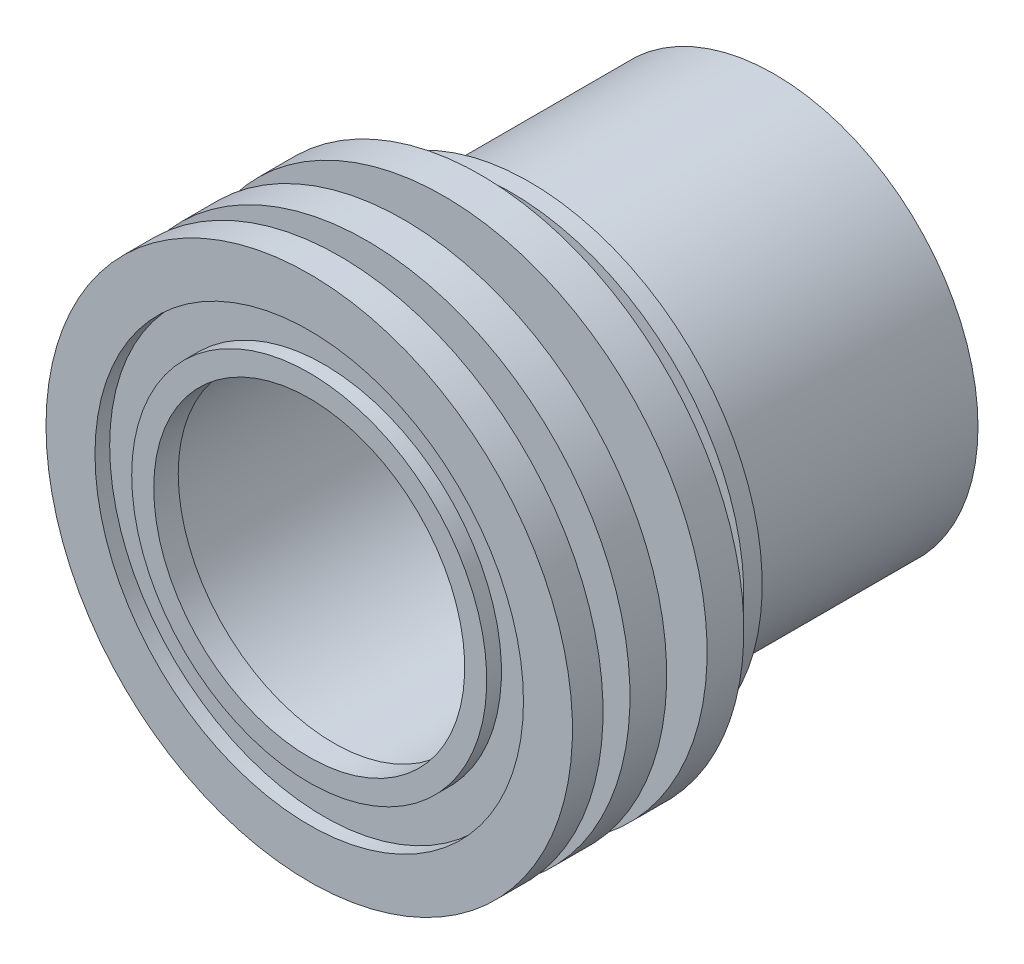
ISO-10303-21;
HEADER;
FILE_DESCRIPTION(('STEP AP214'),'2;1');
FILE_NAME('part.step','',(''),(''),'','','');
FILE_SCHEMA(('AUTOMOTIVE_DESIGN { 1 0 10303 214 1 1 1 1 }'));
ENDSEC;
DATA;
#1=APPLICATION_CONTEXT('core data for automotive mechanical design processes');
#2=APPLICATION_PROTOCOL_DEFINITION('international standard','automotive_design',2000,#1);
#3=PRODUCT_CONTEXT('',#1,'mechanical');
#4=PRODUCT('Part','Part','',(#3));
#5=PRODUCT_RELATED_PRODUCT_CATEGORY('part','',(#4));
#6=PRODUCT_DEFINITION_FORMATION('','',#4);
#7=PRODUCT_DEFINITION_CONTEXT('part definition',#1,'design');
#8=PRODUCT_DEFINITION('design','',#6,#7);
#9=PRODUCT_DEFINITION_SHAPE('','',#8);
#10=(LENGTH_UNIT() NAMED_UNIT(*) SI_UNIT(.MILLI.,.METRE.));
#11=(NAMED_UNIT(*) PLANE_ANGLE_UNIT() SI_UNIT($,.RADIAN.));
#12=(NAMED_UNIT(*) SI_UNIT($,.STERADIAN.) SOLID_ANGLE_UNIT());
#13=UNCERTAINTY_MEASURE_WITH_UNIT(LENGTH_MEASURE(1.E-05),#10,'distance_accuracy_value','');
#14=(GEOMETRIC_REPRESENTATION_CONTEXT(3) GLOBAL_UNCERTAINTY_ASSIGNED_CONTEXT((#13)) GLOBAL_UNIT_ASSIGNED_CONTEXT((#10,
#11,#12)) REPRESENTATION_CONTEXT('',''));
#15=CARTESIAN_POINT('',(0.,0.,0.));
#16=DIRECTION('',(0.,0.,1.));
#17=DIRECTION('',(1.,0.,0.));
#18=AXIS2_PLACEMENT_3D('',#15,#16,#17);
#19=CARTESIAN_POINT('',(0.,0.,17.));
#20=DIRECTION('',(0.,0.,1.));
#21=DIRECTION('',(-1.,0.,0.));
#22=AXIS2_PLACEMENT_3D('',#19,#20,#21);
#23=CYLINDRICAL_SURFACE('',#22,12.7);
#24=CARTESIAN_POINT('',(0.,0.,16.));
#25=DIRECTION('',(0.,0.,-1.));
#26=DIRECTION('',(-1.,0.,0.));
#27=AXIS2_PLACEMENT_3D('',#24,#25,#26);
#28=CIRCLE('',#27,12.7);
#29=CARTESIAN_POINT('',(-12.7,0.,16.));
#30=VERTEX_POINT('',#29);
#31=EDGE_CURVE('E10',#30,#30,#28,.T.);
#32=ORIENTED_EDGE('',*,*,#31,.T.);
#33=EDGE_LOOP('',(#32));
#34=FACE_BOUND('',#33,.T.);
#35=CARTESIAN_POINT('',(0.,0.,18.));
#36=DIRECTION('',(0.,0.,-1.));
#37=DIRECTION('',(-1.,0.,0.));
#38=AXIS2_PLACEMENT_3D('',#35,#36,#37);
#39=CIRCLE('',#38,12.7);
#40=CARTESIAN_POINT('',(-12.7,0.,18.));
#41=VERTEX_POINT('',#40);
#42=EDGE_CURVE('E126',#41,#41,#39,.T.);
#43=ORIENTED_EDGE('',*,*,#42,.F.);
#44=EDGE_LOOP('',(#43));
#45=FACE_BOUND('',#44,.T.);
#46=ADVANCED_FACE('F15',(#34,#45),#23,.F.);
#47=CARTESIAN_POINT('',(-13.1,0.,16.));
#48=DIRECTION('',(0.,0.,-1.));
#49=DIRECTION('',(-1.,0.,0.));
#50=AXIS2_PLACEMENT_3D('',#47,#48,#49);
#51=PLANE('',#50);
#52=CARTESIAN_POINT('',(0.,0.,16.));
#53=DIRECTION('',(0.,0.,-1.));
#54=DIRECTION('',(-1.,0.,0.));
#55=AXIS2_PLACEMENT_3D('',#52,#53,#54);
#56=CIRCLE('',#55,13.5);
#57=CARTESIAN_POINT('',(-13.5,0.,16.));
#58=VERTEX_POINT('',#57);
#59=EDGE_CURVE('E19',#58,#58,#56,.T.);
#60=ORIENTED_EDGE('',*,*,#59,.T.);
#61=EDGE_LOOP('',(#60));
#62=FACE_BOUND('',#61,.T.);
#63=ORIENTED_EDGE('',*,*,#31,.F.);
#64=EDGE_LOOP('',(#63));
#65=FACE_BOUND('',#64,.T.);
#66=ADVANCED_FACE('F17',(#62,#65),#51,.T.);
#67=CARTESIAN_POINT('',(0.,0.,-2.));
#68=DIRECTION('',(0.,0.,1.));
#69=DIRECTION('',(-1.,0.,0.));
#70=AXIS2_PLACEMENT_3D('',#67,#68,#69);
#71=CYLINDRICAL_SURFACE('',#70,13.5);
#72=CARTESIAN_POINT('',(0.,0.,-20.));
#73=DIRECTION('',(0.,0.,-1.));
#74=DIRECTION('',(-1.,0.,0.));
#75=AXIS2_PLACEMENT_3D('',#72,#73,#74);
#76=CIRCLE('',#75,13.5);
#77=CARTESIAN_POINT('',(-13.5,0.,-20.));
#78=VERTEX_POINT('',#77);
#79=EDGE_CURVE('E99',#78,#78,#76,.T.);
#80=ORIENTED_EDGE('',*,*,#79,.T.);
#81=EDGE_LOOP('',(#80));
#82=FACE_BOUND('',#81,.T.);
#83=ORIENTED_EDGE('',*,*,#59,.F.);
#84=EDGE_LOOP('',(#83));
#85=FACE_BOUND('',#84,.T.);
#86=ADVANCED_FACE('F165',(#82,#85),#71,.F.);
#87=CARTESIAN_POINT('',(-15.0625,0.,-20.));
#88=DIRECTION('',(0.,0.,-1.));
#89=DIRECTION('',(-1.,0.,0.));
#90=AXIS2_PLACEMENT_3D('',#87,#88,#89);
#91=PLANE('',#90);
#92=CARTESIAN_POINT('',(0.,0.,-20.));
#93=DIRECTION('',(0.,0.,-1.));
#94=DIRECTION('',(-1.,0.,0.));
#95=AXIS2_PLACEMENT_3D('',#92,#93,#94);
#96=CIRCLE('',#95,16.625);
#97=CARTESIAN_POINT('',(-16.625,0.,-20.));
#98=VERTEX_POINT('',#97);
#99=EDGE_CURVE('E95',#98,#98,#96,.T.);
#100=ORIENTED_EDGE('',*,*,#99,.T.);
#101=EDGE_LOOP('',(#100));
#102=FACE_BOUND('',#101,.T.);
#103=ORIENTED_EDGE('',*,*,#79,.F.);
#104=EDGE_LOOP('',(#103));
#105=FACE_BOUND('',#104,.T.);
#106=ADVANCED_FACE('F96',(#102,#105),#91,.T.);
#107=CARTESIAN_POINT('',(0.,0.,-10.));
#108=DIRECTION('',(0.,0.,1.));
#109=DIRECTION('',(-1.,0.,0.));
#110=AXIS2_PLACEMENT_3D('',#107,#108,#109);
#111=CYLINDRICAL_SURFACE('',#110,16.625);
#112=CARTESIAN_POINT('',(0.,0.,0.));
#113=DIRECTION('',(0.,0.,-1.));
#114=DIRECTION('',(-1.,0.,0.));
#115=AXIS2_PLACEMENT_3D('',#112,#113,#114);
#116=CIRCLE('',#115,16.625);
#117=CARTESIAN_POINT('',(-16.625,0.,0.));
#118=VERTEX_POINT('',#117);
#119=EDGE_CURVE('E100',#118,#118,#116,.T.);
#120=ORIENTED_EDGE('',*,*,#119,.T.);
#121=EDGE_LOOP('',(#120));
#122=FACE_BOUND('',#121,.T.);
#123=ORIENTED_EDGE('',*,*,#99,.F.);
#124=EDGE_LOOP('',(#123));
#125=FACE_BOUND('',#124,.T.);
#126=ADVANCED_FACE('F243',(#122,#125),#111,.T.);
#127=CARTESIAN_POINT('',(-17.8125,0.,0.));
#128=DIRECTION('',(0.,0.,-1.));
#129=DIRECTION('',(-1.,0.,0.));
#130=AXIS2_PLACEMENT_3D('',#127,#128,#129);
#131=PLANE('',#130);
#132=CARTESIAN_POINT('',(0.,0.,0.));
#133=DIRECTION('',(0.,0.,-1.));
#134=DIRECTION('',(-1.,0.,0.));
#135=AXIS2_PLACEMENT_3D('',#132,#133,#134);
#136=CIRCLE('',#135,19.);
#137=CARTESIAN_POINT('',(-19.,0.,0.));
#138=VERTEX_POINT('',#137);
#139=EDGE_CURVE('E102',#138,#138,#136,.T.);
#140=ORIENTED_EDGE('',*,*,#139,.T.);
#141=EDGE_LOOP('',(#140));
#142=FACE_BOUND('',#141,.T.);
#143=ORIENTED_EDGE('',*,*,#119,.F.);
#144=EDGE_LOOP('',(#143));
#145=FACE_BOUND('',#144,.T.);
#146=ADVANCED_FACE('F170',(#142,#145),#131,.T.);
#147=CARTESIAN_POINT('',(0.,0.,0.75));
#148=DIRECTION('',(0.,0.,1.));
#149=DIRECTION('',(-1.,0.,0.));
#150=AXIS2_PLACEMENT_3D('',#147,#148,#149);
#151=CYLINDRICAL_SURFACE('',#150,19.);
#152=CARTESIAN_POINT('',(0.,0.,1.5));
#153=DIRECTION('',(0.,0.,-1.));
#154=DIRECTION('',(-1.,0.,0.));
#155=AXIS2_PLACEMENT_3D('',#152,#153,#154);
#156=CIRCLE('',#155,19.);
#157=CARTESIAN_POINT('',(-19.,0.,1.5));
#158=VERTEX_POINT('',#157);
#159=EDGE_CURVE('E119',#158,#158,#156,.T.);
#160=ORIENTED_EDGE('',*,*,#159,.T.);
#161=EDGE_LOOP('',(#160));
#162=FACE_BOUND('',#161,.T.);
#163=ORIENTED_EDGE('',*,*,#139,.F.);
#164=EDGE_LOOP('',(#163));
#165=FACE_BOUND('',#164,.T.);
#166=ADVANCED_FACE('F251',(#162,#165),#151,.T.);
#167=CARTESIAN_POINT('',(-17.75,0.,1.5));
#168=DIRECTION('',(0.,0.,1.));
#169=DIRECTION('',(1.,0.,0.));
#170=AXIS2_PLACEMENT_3D('',#167,#168,#169);
#171=PLANE('',#170);
#172=CARTESIAN_POINT('',(0.,0.,1.5));
#173=DIRECTION('',(0.,0.,-1.));
#174=DIRECTION('',(-1.,0.,0.));
#175=AXIS2_PLACEMENT_3D('',#172,#173,#174);
#176=CIRCLE('',#175,16.5);
#177=CARTESIAN_POINT('',(-16.5,0.,1.5));
#178=VERTEX_POINT('',#177);
#179=EDGE_CURVE('E122',#178,#178,#176,.T.);
#180=ORIENTED_EDGE('',*,*,#179,.T.);
#181=EDGE_LOOP('',(#180));
#182=FACE_BOUND('',#181,.T.);
#183=ORIENTED_EDGE('',*,*,#159,.F.);
#184=EDGE_LOOP('',(#183));
#185=FACE_BOUND('',#184,.T.);
#186=ADVANCED_FACE('F157',(#182,#185),#171,.T.);
#187=CARTESIAN_POINT('',(0.,0.,2.75));
#188=DIRECTION('',(0.,0.,1.));
#189=DIRECTION('',(-1.,0.,0.));
#190=AXIS2_PLACEMENT_3D('',#187,#188,#189);
#191=CYLINDRICAL_SURFACE('',#190,16.5);
#192=CARTESIAN_POINT('',(0.,0.,4.));
#193=DIRECTION('',(0.,0.,-1.));
#194=DIRECTION('',(-1.,0.,0.));
#195=AXIS2_PLACEMENT_3D('',#192,#193,#194);
#196=CIRCLE('',#195,16.5);
#197=CARTESIAN_POINT('',(-16.5,0.,4.));
#198=VERTEX_POINT('',#197);
#199=EDGE_CURVE('E125',#198,#198,#196,.T.);
#200=ORIENTED_EDGE('',*,*,#199,.T.);
#201=EDGE_LOOP('',(#200));
#202=FACE_BOUND('',#201,.T.);
#203=ORIENTED_EDGE('',*,*,#179,.F.);
#204=EDGE_LOOP('',(#203));
#205=FACE_BOUND('',#204,.T.);
#206=ADVANCED_FACE('F142',(#202,#205),#191,.T.);
#207=CARTESIAN_POINT('',(-19.,0.,4.));
#208=DIRECTION('',(0.,0.,-1.));
#209=DIRECTION('',(-1.,0.,0.));
#210=AXIS2_PLACEMENT_3D('',#207,#208,#209);
#211=PLANE('',#210);
#212=CARTESIAN_POINT('',(0.,0.,4.));
#213=DIRECTION('',(0.,0.,-1.));
#214=DIRECTION('',(-1.,0.,0.));
#215=AXIS2_PLACEMENT_3D('',#212,#213,#214);
#216=CIRCLE('',#215,21.5);
#217=CARTESIAN_POINT('',(-21.5,0.,4.));
#218=VERTEX_POINT('',#217);
#219=EDGE_CURVE('E138',#218,#218,#216,.T.);
#220=ORIENTED_EDGE('',*,*,#219,.T.);
#221=EDGE_LOOP('',(#220));
#222=FACE_BOUND('',#221,.T.);
#223=ORIENTED_EDGE('',*,*,#199,.F.);
#224=EDGE_LOOP('',(#223));
#225=FACE_BOUND('',#224,.T.);
#226=ADVANCED_FACE('F145',(#222,#225),#211,.T.);
#227=CARTESIAN_POINT('',(0.,0.,5.5));
#228=DIRECTION('',(0.,0.,1.));
#229=DIRECTION('',(-1.,0.,0.));
#230=AXIS2_PLACEMENT_3D('',#227,#228,#229);
#231=CYLINDRICAL_SURFACE('',#230,21.5);
#232=CARTESIAN_POINT('',(0.,0.,7.));
#233=DIRECTION('',(0.,0.,-1.));
#234=DIRECTION('',(-1.,0.,0.));
#235=AXIS2_PLACEMENT_3D('',#232,#233,#234);
#236=CIRCLE('',#235,21.5);
#237=CARTESIAN_POINT('',(-21.5,0.,7.));
#238=VERTEX_POINT('',#237);
#239=EDGE_CURVE('E136',#238,#238,#236,.T.);
#240=ORIENTED_EDGE('',*,*,#239,.T.);
#241=EDGE_LOOP('',(#240));
#242=FACE_BOUND('',#241,.T.);
#243=ORIENTED_EDGE('',*,*,#219,.F.);
#244=EDGE_LOOP('',(#243));
#245=FACE_BOUND('',#244,.T.);
#246=ADVANCED_FACE('F147',(#242,#245),#231,.T.);
#247=CARTESIAN_POINT('',(-19.,0.,7.));
#248=DIRECTION('',(0.,0.,1.));
#249=DIRECTION('',(1.,0.,0.));
#250=AXIS2_PLACEMENT_3D('',#247,#248,#249);
#251=PLANE('',#250);
#252=CARTESIAN_POINT('',(0.,0.,7.));
#253=DIRECTION('',(0.,0.,-1.));
#254=DIRECTION('',(-1.,0.,0.));
#255=AXIS2_PLACEMENT_3D('',#252,#253,#254);
#256=CIRCLE('',#255,16.5);
#257=CARTESIAN_POINT('',(-16.5,0.,7.));
#258=VERTEX_POINT('',#257);
#259=EDGE_CURVE('E134',#258,#258,#256,.T.);
#260=ORIENTED_EDGE('',*,*,#259,.T.);
#261=EDGE_LOOP('',(#260));
#262=FACE_BOUND('',#261,.T.);
#263=ORIENTED_EDGE('',*,*,#239,.F.);
#264=EDGE_LOOP('',(#263));
#265=FACE_BOUND('',#264,.T.);
#266=ADVANCED_FACE('F154',(#262,#265),#251,.T.);
#267=CARTESIAN_POINT('',(0.,0.,8.65));
#268=DIRECTION('',(0.,0.,1.));
#269=DIRECTION('',(-1.,0.,0.));
#270=AXIS2_PLACEMENT_3D('',#267,#268,#269);
#271=CYLINDRICAL_SURFACE('',#270,16.5);
#272=CARTESIAN_POINT('',(0.,0.,10.3));
#273=DIRECTION('',(0.,0.,-1.));
#274=DIRECTION('',(-1.,0.,0.));
#275=AXIS2_PLACEMENT_3D('',#272,#273,#274);
#276=CIRCLE('',#275,16.5);
#277=CARTESIAN_POINT('',(-16.5,0.,10.3));
#278=VERTEX_POINT('',#277);
#279=EDGE_CURVE('E137',#278,#278,#276,.T.);
#280=ORIENTED_EDGE('',*,*,#279,.T.);
#281=EDGE_LOOP('',(#280));
#282=FACE_BOUND('',#281,.T.);
#283=ORIENTED_EDGE('',*,*,#259,.F.);
#284=EDGE_LOOP('',(#283));
#285=FACE_BOUND('',#284,.T.);
#286=ADVANCED_FACE('F207',(#282,#285),#271,.T.);
#287=CARTESIAN_POINT('',(-19.,0.,10.3));
#288=DIRECTION('',(0.,0.,-1.));
#289=DIRECTION('',(-1.,0.,0.));
#290=AXIS2_PLACEMENT_3D('',#287,#288,#289);
#291=PLANE('',#290);
#292=CARTESIAN_POINT('',(0.,0.,10.3));
#293=DIRECTION('',(0.,0.,-1.));
#294=DIRECTION('',(-1.,0.,0.));
#295=AXIS2_PLACEMENT_3D('',#292,#293,#294);
#296=CIRCLE('',#295,21.5);
#297=CARTESIAN_POINT('',(-21.5,0.,10.3));
#298=VERTEX_POINT('',#297);
#299=EDGE_CURVE('E111',#298,#298,#296,.T.);
#300=ORIENTED_EDGE('',*,*,#299,.T.);
#301=EDGE_LOOP('',(#300));
#302=FACE_BOUND('',#301,.T.);
#303=ORIENTED_EDGE('',*,*,#279,.F.);
#304=EDGE_LOOP('',(#303));
#305=FACE_BOUND('',#304,.T.);
#306=ADVANCED_FACE('F182',(#302,#305),#291,.T.);
#307=CARTESIAN_POINT('',(0.,0.,11.8));
#308=DIRECTION('',(0.,0.,1.));
#309=DIRECTION('',(-1.,0.,0.));
#310=AXIS2_PLACEMENT_3D('',#307,#308,#309);
#311=CYLINDRICAL_SURFACE('',#310,21.5);
#312=CARTESIAN_POINT('',(0.,0.,13.3));
#313=DIRECTION('',(0.,0.,-1.));
#314=DIRECTION('',(-1.,0.,0.));
#315=AXIS2_PLACEMENT_3D('',#312,#313,#314);
#316=CIRCLE('',#315,21.5);
#317=CARTESIAN_POINT('',(-21.5,0.,13.3));
#318=VERTEX_POINT('',#317);
#319=EDGE_CURVE('E107',#318,#318,#316,.T.);
#320=ORIENTED_EDGE('',*,*,#319,.T.);
#321=EDGE_LOOP('',(#320));
#322=FACE_BOUND('',#321,.T.);
#323=ORIENTED_EDGE('',*,*,#299,.F.);
#324=EDGE_LOOP('',(#323));
#325=FACE_BOUND('',#324,.T.);
#326=ADVANCED_FACE('F178',(#322,#325),#311,.T.);
#327=CARTESIAN_POINT('',(-19.375,0.,13.3));
#328=DIRECTION('',(0.,0.,1.));
#329=DIRECTION('',(1.,0.,0.));
#330=AXIS2_PLACEMENT_3D('',#327,#328,#329);
#331=PLANE('',#330);
#332=CARTESIAN_POINT('',(0.,0.,13.3));
#333=DIRECTION('',(0.,0.,-1.));
#334=DIRECTION('',(-1.,0.,0.));
#335=AXIS2_PLACEMENT_3D('',#332,#333,#334);
#336=CIRCLE('',#335,17.25);
#337=CARTESIAN_POINT('',(-17.25,0.,13.3));
#338=VERTEX_POINT('',#337);
#339=EDGE_CURVE('E106',#338,#338,#336,.T.);
#340=ORIENTED_EDGE('',*,*,#339,.T.);
#341=EDGE_LOOP('',(#340));
#342=FACE_BOUND('',#341,.T.);
#343=ORIENTED_EDGE('',*,*,#319,.F.);
#344=EDGE_LOOP('',(#343));
#345=FACE_BOUND('',#344,.T.);
#346=ADVANCED_FACE('F181',(#342,#345),#331,.T.);
#347=CARTESIAN_POINT('',(0.,0.,14.4));
#348=DIRECTION('',(0.,0.,1.));
#349=DIRECTION('',(-1.,0.,0.));
#350=AXIS2_PLACEMENT_3D('',#347,#348,#349);
#351=CYLINDRICAL_SURFACE('',#350,17.25);
#352=CARTESIAN_POINT('',(0.,0.,15.5));
#353=DIRECTION('',(0.,0.,-1.));
#354=DIRECTION('',(-1.,0.,0.));
#355=AXIS2_PLACEMENT_3D('',#352,#353,#354);
#356=CIRCLE('',#355,17.25);
#357=CARTESIAN_POINT('',(-17.25,0.,15.5));
#358=VERTEX_POINT('',#357);
#359=EDGE_CURVE('E108',#358,#358,#356,.T.);
#360=ORIENTED_EDGE('',*,*,#359,.T.);
#361=EDGE_LOOP('',(#360));
#362=FACE_BOUND('',#361,.T.);
#363=ORIENTED_EDGE('',*,*,#339,.F.);
#364=EDGE_LOOP('',(#363));
#365=FACE_BOUND('',#364,.T.);
#366=ADVANCED_FACE('F202',(#362,#365),#351,.T.);
#367=CARTESIAN_POINT('',(-19.375,0.,15.5));
#368=DIRECTION('',(0.,0.,-1.));
#369=DIRECTION('',(-1.,0.,0.));
#370=AXIS2_PLACEMENT_3D('',#367,#368,#369);
#371=PLANE('',#370);
#372=CARTESIAN_POINT('',(0.,0.,15.5));
#373=DIRECTION('',(0.,0.,-1.));
#374=DIRECTION('',(-1.,0.,0.));
#375=AXIS2_PLACEMENT_3D('',#372,#373,#374);
#376=CIRCLE('',#375,21.5);
#377=CARTESIAN_POINT('',(-21.5,0.,15.5));
#378=VERTEX_POINT('',#377);
#379=EDGE_CURVE('E113',#378,#378,#376,.T.);
#380=ORIENTED_EDGE('',*,*,#379,.T.);
#381=EDGE_LOOP('',(#380));
#382=FACE_BOUND('',#381,.T.);
#383=ORIENTED_EDGE('',*,*,#359,.F.);
#384=EDGE_LOOP('',(#383));
#385=FACE_BOUND('',#384,.T.);
#386=ADVANCED_FACE('F198',(#382,#385),#371,.T.);
#387=CARTESIAN_POINT('',(0.,0.,16.75));
#388=DIRECTION('',(0.,0.,1.));
#389=DIRECTION('',(-1.,0.,0.));
#390=AXIS2_PLACEMENT_3D('',#387,#388,#389);
#391=CYLINDRICAL_SURFACE('',#390,21.5);
#392=CARTESIAN_POINT('',(0.,0.,18.));
#393=DIRECTION('',(0.,0.,-1.));
#394=DIRECTION('',(-1.,0.,0.));
#395=AXIS2_PLACEMENT_3D('',#392,#393,#394);
#396=CIRCLE('',#395,21.5);
#397=CARTESIAN_POINT('',(-21.5,0.,18.));
#398=VERTEX_POINT('',#397);
#399=EDGE_CURVE('E117',#398,#398,#396,.T.);
#400=ORIENTED_EDGE('',*,*,#399,.T.);
#401=EDGE_LOOP('',(#400));
#402=FACE_BOUND('',#401,.T.);
#403=ORIENTED_EDGE('',*,*,#379,.F.);
#404=EDGE_LOOP('',(#403));
#405=FACE_BOUND('',#404,.T.);
#406=ADVANCED_FACE('F195',(#402,#405),#391,.T.);
#407=CARTESIAN_POINT('',(-19.5,0.,18.));
#408=DIRECTION('',(0.,0.,1.));
#409=DIRECTION('',(1.,0.,0.));
#410=AXIS2_PLACEMENT_3D('',#407,#408,#409);
#411=PLANE('',#410);
#412=CARTESIAN_POINT('',(0.,0.,18.));
#413=DIRECTION('',(0.,0.,-1.));
#414=DIRECTION('',(-1.,0.,0.));
#415=AXIS2_PLACEMENT_3D('',#412,#413,#414);
#416=CIRCLE('',#415,17.5);
#417=CARTESIAN_POINT('',(-17.5,0.,18.));
#418=VERTEX_POINT('',#417);
#419=EDGE_CURVE('E132',#418,#418,#416,.T.);
#420=ORIENTED_EDGE('',*,*,#419,.T.);
#421=EDGE_LOOP('',(#420));
#422=FACE_BOUND('',#421,.T.);
#423=ORIENTED_EDGE('',*,*,#399,.F.);
#424=EDGE_LOOP('',(#423));
#425=FACE_BOUND('',#424,.T.);
#426=ADVANCED_FACE('F193',(#422,#425),#411,.T.);
#427=CARTESIAN_POINT('',(0.,0.,17.4));
#428=DIRECTION('',(0.,0.,1.));
#429=DIRECTION('',(-1.,0.,0.));
#430=AXIS2_PLACEMENT_3D('',#427,#428,#429);
#431=CYLINDRICAL_SURFACE('',#430,17.5);
#432=CARTESIAN_POINT('',(0.,0.,16.8));
#433=DIRECTION('',(0.,0.,-1.));
#434=DIRECTION('',(-1.,0.,0.));
#435=AXIS2_PLACEMENT_3D('',#432,#433,#434);
#436=CIRCLE('',#435,17.5);
#437=CARTESIAN_POINT('',(-17.5,0.,16.8));
#438=VERTEX_POINT('',#437);
#439=EDGE_CURVE('E130',#438,#438,#436,.T.);
#440=ORIENTED_EDGE('',*,*,#439,.T.);
#441=EDGE_LOOP('',(#440));
#442=FACE_BOUND('',#441,.T.);
#443=ORIENTED_EDGE('',*,*,#419,.F.);
#444=EDGE_LOOP('',(#443));
#445=FACE_BOUND('',#444,.T.);
#446=ADVANCED_FACE('F176',(#442,#445),#431,.F.);
#447=CARTESIAN_POINT('',(-16.,0.,16.8));
#448=DIRECTION('',(0.,0.,1.));
#449=DIRECTION('',(1.,0.,0.));
#450=AXIS2_PLACEMENT_3D('',#447,#448,#449);
#451=PLANE('',#450);
#452=CARTESIAN_POINT('',(0.,0.,16.8));
#453=DIRECTION('',(0.,0.,-1.));
#454=DIRECTION('',(-1.,0.,0.));
#455=AXIS2_PLACEMENT_3D('',#452,#453,#454);
#456=CIRCLE('',#455,14.5);
#457=CARTESIAN_POINT('',(-14.5,0.,16.8));
#458=VERTEX_POINT('',#457);
#459=EDGE_CURVE('E128',#458,#458,#456,.T.);
#460=ORIENTED_EDGE('',*,*,#459,.T.);
#461=EDGE_LOOP('',(#460));
#462=FACE_BOUND('',#461,.T.);
#463=ORIENTED_EDGE('',*,*,#439,.F.);
#464=EDGE_LOOP('',(#463));
#465=FACE_BOUND('',#464,.T.);
#466=ADVANCED_FACE('F172',(#462,#465),#451,.T.);
#467=CARTESIAN_POINT('',(0.,0.,17.4));
#468=DIRECTION('',(0.,0.,1.));
#469=DIRECTION('',(-1.,0.,0.));
#470=AXIS2_PLACEMENT_3D('',#467,#468,#469);
#471=CYLINDRICAL_SURFACE('',#470,14.5);
#472=CARTESIAN_POINT('',(0.,0.,18.));
#473=DIRECTION('',(0.,0.,-1.));
#474=DIRECTION('',(-1.,0.,0.));
#475=AXIS2_PLACEMENT_3D('',#472,#473,#474);
#476=CIRCLE('',#475,14.5);
#477=CARTESIAN_POINT('',(-14.5,0.,18.));
#478=VERTEX_POINT('',#477);
#479=EDGE_CURVE('E129',#478,#478,#476,.T.);
#480=ORIENTED_EDGE('',*,*,#479,.T.);
#481=EDGE_LOOP('',(#480));
#482=FACE_BOUND('',#481,.T.);
#483=ORIENTED_EDGE('',*,*,#459,.F.);
#484=EDGE_LOOP('',(#483));
#485=FACE_BOUND('',#484,.T.);
#486=ADVANCED_FACE('F175',(#482,#485),#471,.T.);
#487=CARTESIAN_POINT('',(-13.6,0.,18.));
#488=DIRECTION('',(0.,0.,1.));
#489=DIRECTION('',(1.,0.,0.));
#490=AXIS2_PLACEMENT_3D('',#487,#488,#489);
#491=PLANE('',#490);
#492=ORIENTED_EDGE('',*,*,#42,.T.);
#493=EDGE_LOOP('',(#492));
#494=FACE_BOUND('',#493,.T.);
#495=ORIENTED_EDGE('',*,*,#479,.F.);
#496=EDGE_LOOP('',(#495));
#497=FACE_BOUND('',#496,.T.);
#498=ADVANCED_FACE('F184',(#494,#497),#491,.T.);
#499=CLOSED_SHELL('',(#46,#66,#86,#106,#126,#146,#166,#186,#206,#226,#246,#266,#286,#306,#326,
#346,#366,#386,#406,#426,#446,#466,#486,#498));
#500=MANIFOLD_SOLID_BREP('B1',#499);
#501=ADVANCED_BREP_SHAPE_REPRESENTATION('',(#18,#500),#14);
#502=SHAPE_DEFINITION_REPRESENTATION(#9,#501);
ENDSEC;
END-ISO-10303-21;
